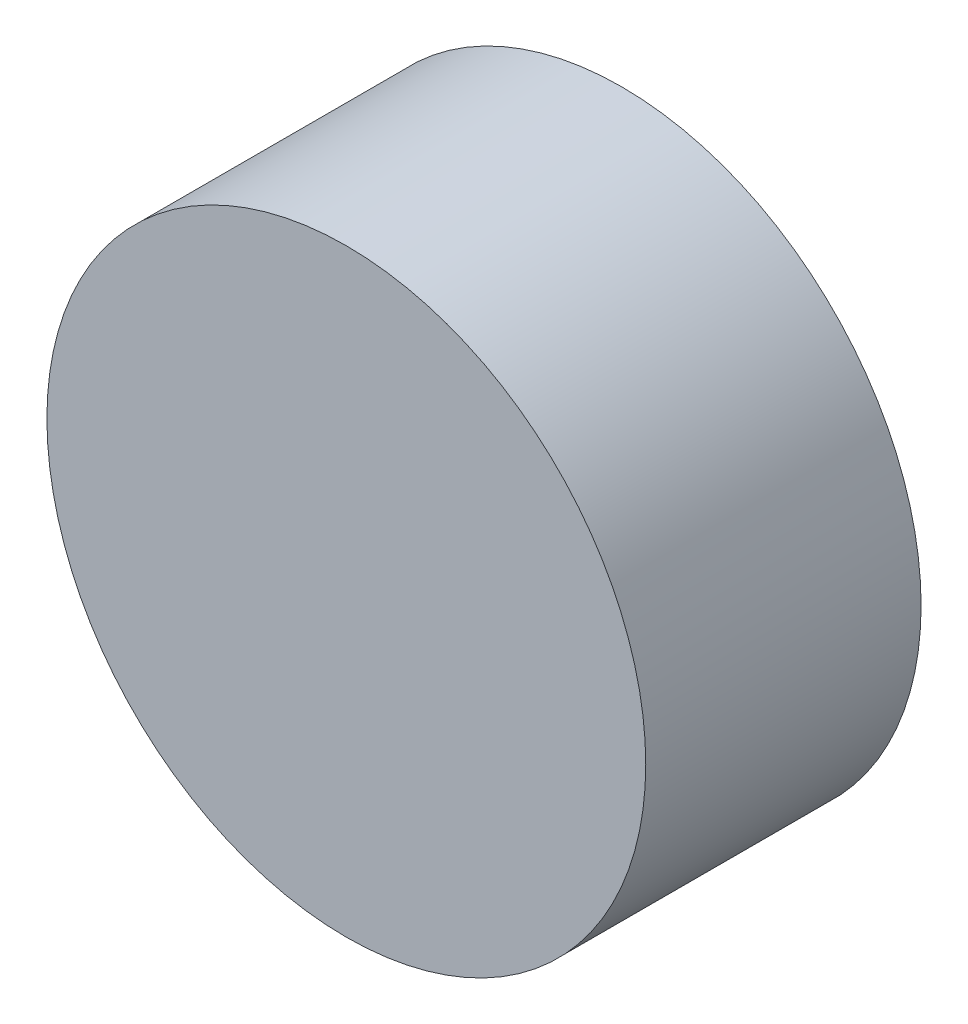
ISO-10303-21;
HEADER;
FILE_DESCRIPTION(('STEP AP214'),'2;1');
FILE_NAME('part.step','',(''),(''),'','','');
FILE_SCHEMA(('AUTOMOTIVE_DESIGN { 1 0 10303 214 1 1 1 1 }'));
ENDSEC;
DATA;
#1=APPLICATION_CONTEXT('core data for automotive mechanical design processes');
#2=APPLICATION_PROTOCOL_DEFINITION('international standard','automotive_design',2000,#1);
#3=PRODUCT_CONTEXT('',#1,'mechanical');
#4=PRODUCT('Part','Part','',(#3));
#5=PRODUCT_RELATED_PRODUCT_CATEGORY('part','',(#4));
#6=PRODUCT_DEFINITION_FORMATION('','',#4);
#7=PRODUCT_DEFINITION_CONTEXT('part definition',#1,'design');
#8=PRODUCT_DEFINITION('design','',#6,#7);
#9=PRODUCT_DEFINITION_SHAPE('','',#8);
#10=(LENGTH_UNIT() NAMED_UNIT(*) SI_UNIT(.MILLI.,.METRE.));
#11=(NAMED_UNIT(*) PLANE_ANGLE_UNIT() SI_UNIT($,.RADIAN.));
#12=(NAMED_UNIT(*) SI_UNIT($,.STERADIAN.) SOLID_ANGLE_UNIT());
#13=UNCERTAINTY_MEASURE_WITH_UNIT(LENGTH_MEASURE(1.E-05),#10,'distance_accuracy_value','');
#14=(GEOMETRIC_REPRESENTATION_CONTEXT(3) GLOBAL_UNCERTAINTY_ASSIGNED_CONTEXT((#13)) GLOBAL_UNIT_ASSIGNED_CONTEXT((#10,
#11,#12)) REPRESENTATION_CONTEXT('',''));
#15=CARTESIAN_POINT('',(0.,0.,0.));
#16=DIRECTION('',(0.,0.,1.));
#17=DIRECTION('',(1.,0.,0.));
#18=AXIS2_PLACEMENT_3D('',#15,#16,#17);
#19=CARTESIAN_POINT('',(1.3050012,0.,0.));
#20=DIRECTION('',(0.,0.,-1.));
#21=DIRECTION('',(-1.,0.,0.));
#22=AXIS2_PLACEMENT_3D('',#19,#20,#21);
#23=PLANE('',#22);
#24=CARTESIAN_POINT('',(0.,0.,0.));
#25=DIRECTION('',(0.,0.,-1.));
#26=DIRECTION('',(-1.,0.,0.));
#27=AXIS2_PLACEMENT_3D('',#24,#25,#26);
#28=CIRCLE('',#27,1.3050012);
#29=CARTESIAN_POINT('',(-1.3050012,0.,0.));
#30=VERTEX_POINT('',#29);
#31=EDGE_CURVE('E18',#30,#30,#28,.F.);
#32=ORIENTED_EDGE('',*,*,#31,.F.);
#33=EDGE_LOOP('',(#32));
#34=FACE_BOUND('',#33,.T.);
#35=ADVANCED_FACE('F15',(#34),#23,.T.);
#36=CARTESIAN_POINT('',(1.3050012,0.,1.20000014));
#37=DIRECTION('',(0.,0.,-1.));
#38=DIRECTION('',(-1.,0.,0.));
#39=AXIS2_PLACEMENT_3D('',#36,#37,#38);
#40=PLANE('',#39);
#41=CARTESIAN_POINT('',(0.,0.,1.20000014));
#42=DIRECTION('',(0.,0.,-1.));
#43=DIRECTION('',(-1.,0.,0.));
#44=AXIS2_PLACEMENT_3D('',#41,#42,#43);
#45=CIRCLE('',#44,1.3050012);
#46=CARTESIAN_POINT('',(-1.3050012,0.,1.20000014));
#47=VERTEX_POINT('',#46);
#48=EDGE_CURVE('E10',#47,#47,#45,.T.);
#49=ORIENTED_EDGE('',*,*,#48,.F.);
#50=EDGE_LOOP('',(#49));
#51=FACE_BOUND('',#50,.T.);
#52=ADVANCED_FACE('F30',(#51),#40,.F.);
#53=CARTESIAN_POINT('',(0.,0.,0.));
#54=DIRECTION('',(0.,0.,-1.));
#55=DIRECTION('',(-1.,0.,0.));
#56=AXIS2_PLACEMENT_3D('',#53,#54,#55);
#57=CYLINDRICAL_SURFACE('',#56,1.3050012);
#58=ORIENTED_EDGE('',*,*,#48,.T.);
#59=EDGE_LOOP('',(#58));
#60=FACE_BOUND('',#59,.T.);
#61=ORIENTED_EDGE('',*,*,#31,.T.);
#62=EDGE_LOOP('',(#61));
#63=FACE_BOUND('',#62,.T.);
#64=ADVANCED_FACE('F27',(#60,#63),#57,.T.);
#65=CLOSED_SHELL('',(#35,#52,#64));
#66=MANIFOLD_SOLID_BREP('B1',#65);
#67=ADVANCED_BREP_SHAPE_REPRESENTATION('',(#18,#66),#14);
#68=SHAPE_DEFINITION_REPRESENTATION(#9,#67);
ENDSEC;
END-ISO-10303-21;
